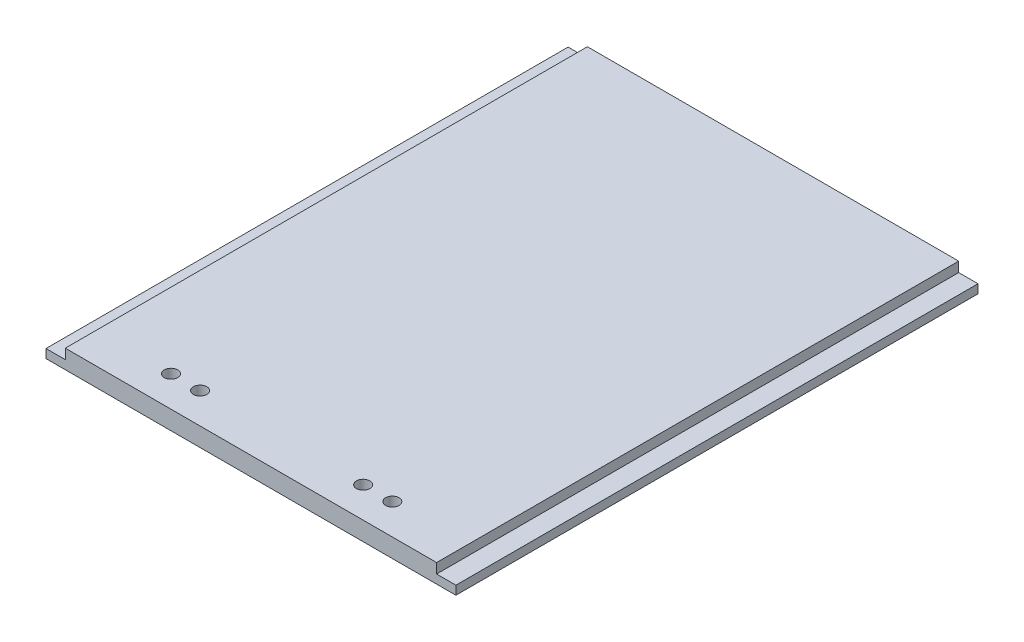
ISO-10303-21;
HEADER;
FILE_DESCRIPTION(('STEP AP214'),'2;1');
FILE_NAME('part.step','',(''),(''),'','','');
FILE_SCHEMA(('AUTOMOTIVE_DESIGN { 1 0 10303 214 1 1 1 1 }'));
ENDSEC;
DATA;
#1=APPLICATION_CONTEXT('core data for automotive mechanical design processes');
#2=APPLICATION_PROTOCOL_DEFINITION('international standard','automotive_design',2000,#1);
#3=PRODUCT_CONTEXT('',#1,'mechanical');
#4=PRODUCT('Part','Part','',(#3));
#5=PRODUCT_RELATED_PRODUCT_CATEGORY('part','',(#4));
#6=PRODUCT_DEFINITION_FORMATION('','',#4);
#7=PRODUCT_DEFINITION_CONTEXT('part definition',#1,'design');
#8=PRODUCT_DEFINITION('design','',#6,#7);
#9=PRODUCT_DEFINITION_SHAPE('','',#8);
#10=(LENGTH_UNIT() NAMED_UNIT(*) SI_UNIT(.MILLI.,.METRE.));
#11=(NAMED_UNIT(*) PLANE_ANGLE_UNIT() SI_UNIT($,.RADIAN.));
#12=(NAMED_UNIT(*) SI_UNIT($,.STERADIAN.) SOLID_ANGLE_UNIT());
#13=UNCERTAINTY_MEASURE_WITH_UNIT(LENGTH_MEASURE(1.E-05),#10,'distance_accuracy_value','');
#14=(GEOMETRIC_REPRESENTATION_CONTEXT(3) GLOBAL_UNCERTAINTY_ASSIGNED_CONTEXT((#13)) GLOBAL_UNIT_ASSIGNED_CONTEXT((#10,
#11,#12)) REPRESENTATION_CONTEXT('',''));
#15=CARTESIAN_POINT('',(0.,0.,0.));
#16=DIRECTION('',(0.,0.,1.));
#17=DIRECTION('',(1.,0.,0.));
#18=AXIS2_PLACEMENT_3D('',#15,#16,#17);
#19=CARTESIAN_POINT('',(0.,6.35,0.));
#20=DIRECTION('',(1.,0.,0.));
#21=DIRECTION('',(0.,0.,-1.));
#22=AXIS2_PLACEMENT_3D('',#19,#20,#21);
#23=PLANE('',#22);
#24=DIRECTION('',(0.,0.,1.));
#25=VECTOR('',#24,1.);
#26=CARTESIAN_POINT('',(0.,2.975,-177.292));
#27=LINE('',#26,#25);
#28=CARTESIAN_POINT('',(0.,2.975,-177.292));
#29=VERTEX_POINT('',#28);
#30=CARTESIAN_POINT('',(0.,2.975,0.));
#31=VERTEX_POINT('',#30);
#32=EDGE_CURVE('E100',#29,#31,#27,.T.);
#33=ORIENTED_EDGE('',*,*,#32,.F.);
#34=DIRECTION('',(0.,-1.,0.));
#35=VECTOR('',#34,1.);
#36=CARTESIAN_POINT('',(0.,6.35,-177.292));
#37=LINE('',#36,#35);
#38=CARTESIAN_POINT('',(0.,0.,-177.292));
#39=VERTEX_POINT('',#38);
#40=EDGE_CURVE('E122',#29,#39,#37,.T.);
#41=ORIENTED_EDGE('',*,*,#40,.T.);
#42=DIRECTION('',(0.,0.,1.));
#43=VECTOR('',#42,1.);
#44=CARTESIAN_POINT('',(0.,0.,0.));
#45=LINE('',#44,#43);
#46=CARTESIAN_POINT('',(0.,0.,0.));
#47=VERTEX_POINT('',#46);
#48=EDGE_CURVE('E121',#39,#47,#45,.T.);
#49=ORIENTED_EDGE('',*,*,#48,.T.);
#50=DIRECTION('',(0.,-1.,0.));
#51=VECTOR('',#50,1.);
#52=CARTESIAN_POINT('',(0.,6.35,0.));
#53=LINE('',#52,#51);
#54=EDGE_CURVE('E11',#31,#47,#53,.T.);
#55=ORIENTED_EDGE('',*,*,#54,.F.);
#56=EDGE_LOOP('',(#33,#41,#49,#55));
#57=FACE_BOUND('',#56,.T.);
#58=ADVANCED_FACE('F37',(#57),#23,.F.);
#59=CARTESIAN_POINT('',(139.192,6.35,0.));
#60=DIRECTION('',(-1.,0.,0.));
#61=DIRECTION('',(0.,0.,1.));
#62=AXIS2_PLACEMENT_3D('',#59,#60,#61);
#63=PLANE('',#62);
#64=DIRECTION('',(0.,0.,-1.));
#65=VECTOR('',#64,1.);
#66=CARTESIAN_POINT('',(139.192,2.975,-177.292));
#67=LINE('',#66,#65);
#68=CARTESIAN_POINT('',(139.192,2.975,0.));
#69=VERTEX_POINT('',#68);
#70=CARTESIAN_POINT('',(139.192,2.975,-177.292));
#71=VERTEX_POINT('',#70);
#72=EDGE_CURVE('E150',#69,#71,#67,.T.);
#73=ORIENTED_EDGE('',*,*,#72,.F.);
#74=DIRECTION('',(0.,-1.,0.));
#75=VECTOR('',#74,1.);
#76=CARTESIAN_POINT('',(139.192,6.35,0.));
#77=LINE('',#76,#75);
#78=CARTESIAN_POINT('',(139.192,0.,0.));
#79=VERTEX_POINT('',#78);
#80=EDGE_CURVE('E44',#69,#79,#77,.T.);
#81=ORIENTED_EDGE('',*,*,#80,.T.);
#82=DIRECTION('',(0.,0.,-1.));
#83=VECTOR('',#82,1.);
#84=CARTESIAN_POINT('',(139.192,0.,0.));
#85=LINE('',#84,#83);
#86=CARTESIAN_POINT('',(139.192,0.,-177.292));
#87=VERTEX_POINT('',#86);
#88=EDGE_CURVE('E129',#79,#87,#85,.T.);
#89=ORIENTED_EDGE('',*,*,#88,.T.);
#90=DIRECTION('',(0.,-1.,0.));
#91=VECTOR('',#90,1.);
#92=CARTESIAN_POINT('',(139.192,6.35,-177.292));
#93=LINE('',#92,#91);
#94=EDGE_CURVE('E143',#71,#87,#93,.T.);
#95=ORIENTED_EDGE('',*,*,#94,.F.);
#96=EDGE_LOOP('',(#73,#81,#89,#95));
#97=FACE_BOUND('',#96,.T.);
#98=ADVANCED_FACE('F147',(#97),#63,.F.);
#99=CARTESIAN_POINT('',(0.,6.35,0.));
#100=DIRECTION('',(0.,0.,-1.));
#101=DIRECTION('',(-1.,0.,0.));
#102=AXIS2_PLACEMENT_3D('',#99,#100,#101);
#103=PLANE('',#102);
#104=DIRECTION('',(1.,0.,0.));
#105=VECTOR('',#104,1.);
#106=CARTESIAN_POINT('',(0.,6.35,0.));
#107=LINE('',#106,#105);
#108=CARTESIAN_POINT('',(6.55000000000002,6.35,0.));
#109=VERTEX_POINT('',#108);
#110=CARTESIAN_POINT('',(132.642,6.35,0.));
#111=VERTEX_POINT('',#110);
#112=EDGE_CURVE('E141',#109,#111,#107,.T.);
#113=ORIENTED_EDGE('',*,*,#112,.F.);
#114=DIRECTION('',(0.,1.,0.));
#115=VECTOR('',#114,1.);
#116=CARTESIAN_POINT('',(6.55000000000002,2.975,0.));
#117=LINE('',#116,#115);
#118=CARTESIAN_POINT('',(6.55000000000002,2.975,0.));
#119=VERTEX_POINT('',#118);
#120=EDGE_CURVE('E59',#119,#109,#117,.T.);
#121=ORIENTED_EDGE('',*,*,#120,.F.);
#122=DIRECTION('',(1.,0.,0.));
#123=VECTOR('',#122,1.);
#124=CARTESIAN_POINT('',(0.,2.975,0.));
#125=LINE('',#124,#123);
#126=EDGE_CURVE('E104',#31,#119,#125,.T.);
#127=ORIENTED_EDGE('',*,*,#126,.F.);
#128=ORIENTED_EDGE('',*,*,#54,.T.);
#129=DIRECTION('',(1.,0.,0.));
#130=VECTOR('',#129,1.);
#131=CARTESIAN_POINT('',(0.,0.,0.));
#132=LINE('',#131,#130);
#133=EDGE_CURVE('E126',#47,#79,#132,.T.);
#134=ORIENTED_EDGE('',*,*,#133,.T.);
#135=ORIENTED_EDGE('',*,*,#80,.F.);
#136=DIRECTION('',(1.,0.,0.));
#137=VECTOR('',#136,1.);
#138=CARTESIAN_POINT('',(139.192,2.975,0.));
#139=LINE('',#138,#137);
#140=CARTESIAN_POINT('',(132.642,2.975,0.));
#141=VERTEX_POINT('',#140);
#142=EDGE_CURVE('E164',#141,#69,#139,.T.);
#143=ORIENTED_EDGE('',*,*,#142,.F.);
#144=DIRECTION('',(0.,1.,0.));
#145=VECTOR('',#144,1.);
#146=CARTESIAN_POINT('',(132.642,2.975,0.));
#147=LINE('',#146,#145);
#148=EDGE_CURVE('E172',#141,#111,#147,.T.);
#149=ORIENTED_EDGE('',*,*,#148,.T.);
#150=EDGE_LOOP('',(#113,#121,#127,#128,#134,#135,#143,#149));
#151=FACE_BOUND('',#150,.T.);
#152=ADVANCED_FACE('F114',(#151),#103,.F.);
#153=CARTESIAN_POINT('',(0.,6.35,-177.292));
#154=DIRECTION('',(0.,0.,1.));
#155=DIRECTION('',(1.,0.,0.));
#156=AXIS2_PLACEMENT_3D('',#153,#154,#155);
#157=PLANE('',#156);
#158=DIRECTION('',(-1.,0.,0.));
#159=VECTOR('',#158,1.);
#160=CARTESIAN_POINT('',(0.,2.975,-177.292));
#161=LINE('',#160,#159);
#162=CARTESIAN_POINT('',(6.55,2.975,-177.292));
#163=VERTEX_POINT('',#162);
#164=EDGE_CURVE('E106',#163,#29,#161,.T.);
#165=ORIENTED_EDGE('',*,*,#164,.F.);
#166=DIRECTION('',(0.,1.,0.));
#167=VECTOR('',#166,1.);
#168=CARTESIAN_POINT('',(6.55,2.975,-177.292));
#169=LINE('',#168,#167);
#170=CARTESIAN_POINT('',(6.55,6.35,-177.292));
#171=VERTEX_POINT('',#170);
#172=EDGE_CURVE('E127',#163,#171,#169,.T.);
#173=ORIENTED_EDGE('',*,*,#172,.T.);
#174=DIRECTION('',(-1.,0.,0.));
#175=VECTOR('',#174,1.);
#176=CARTESIAN_POINT('',(0.,6.35,-177.292));
#177=LINE('',#176,#175);
#178=CARTESIAN_POINT('',(132.642,6.35,-177.292));
#179=VERTEX_POINT('',#178);
#180=EDGE_CURVE('E134',#179,#171,#177,.T.);
#181=ORIENTED_EDGE('',*,*,#180,.F.);
#182=DIRECTION('',(0.,1.,0.));
#183=VECTOR('',#182,1.);
#184=CARTESIAN_POINT('',(132.642,2.975,-177.292));
#185=LINE('',#184,#183);
#186=CARTESIAN_POINT('',(132.642,2.975,-177.292));
#187=VERTEX_POINT('',#186);
#188=EDGE_CURVE('E51',#187,#179,#185,.T.);
#189=ORIENTED_EDGE('',*,*,#188,.F.);
#190=DIRECTION('',(-1.,0.,0.));
#191=VECTOR('',#190,1.);
#192=CARTESIAN_POINT('',(139.192,2.975,-177.292));
#193=LINE('',#192,#191);
#194=EDGE_CURVE('E157',#71,#187,#193,.T.);
#195=ORIENTED_EDGE('',*,*,#194,.F.);
#196=ORIENTED_EDGE('',*,*,#94,.T.);
#197=DIRECTION('',(-1.,0.,0.));
#198=VECTOR('',#197,1.);
#199=CARTESIAN_POINT('',(0.,0.,-177.292));
#200=LINE('',#199,#198);
#201=EDGE_CURVE('E139',#87,#39,#200,.T.);
#202=ORIENTED_EDGE('',*,*,#201,.T.);
#203=ORIENTED_EDGE('',*,*,#40,.F.);
#204=EDGE_LOOP('',(#165,#173,#181,#189,#195,#196,#202,#203));
#205=FACE_BOUND('',#204,.T.);
#206=ADVANCED_FACE('F154',(#205),#157,.F.);
#207=CARTESIAN_POINT('',(0.,6.35,0.));
#208=DIRECTION('',(0.,-1.,0.));
#209=DIRECTION('',(0.,0.,-1.));
#210=AXIS2_PLACEMENT_3D('',#207,#208,#209);
#211=PLANE('',#210);
#212=CARTESIAN_POINT('',(107.188,6.35,-10.414));
#213=DIRECTION('',(0.,-1.,0.));
#214=DIRECTION('',(0.,0.,-1.));
#215=AXIS2_PLACEMENT_3D('',#212,#213,#214);
#216=CIRCLE('',#215,2.28599999999999);
#217=CARTESIAN_POINT('',(107.188,6.35,-12.7));
#218=VERTEX_POINT('',#217);
#219=EDGE_CURVE('E166',#218,#218,#216,.T.);
#220=ORIENTED_EDGE('',*,*,#219,.T.);
#221=EDGE_LOOP('',(#220));
#222=FACE_BOUND('',#221,.T.);
#223=CARTESIAN_POINT('',(97.282,6.35,-10.414));
#224=DIRECTION('',(0.,-1.,0.));
#225=DIRECTION('',(0.,0.,-1.));
#226=AXIS2_PLACEMENT_3D('',#223,#224,#225);
#227=CIRCLE('',#226,2.28599999999999);
#228=CARTESIAN_POINT('',(97.282,6.35,-12.7));
#229=VERTEX_POINT('',#228);
#230=EDGE_CURVE('E186',#229,#229,#227,.T.);
#231=ORIENTED_EDGE('',*,*,#230,.T.);
#232=EDGE_LOOP('',(#231));
#233=FACE_BOUND('',#232,.T.);
#234=CARTESIAN_POINT('',(41.91,6.35,-10.414));
#235=DIRECTION('',(0.,-1.,0.));
#236=DIRECTION('',(0.,0.,-1.));
#237=AXIS2_PLACEMENT_3D('',#234,#235,#236);
#238=CIRCLE('',#237,2.28599999999999);
#239=CARTESIAN_POINT('',(41.91,6.35,-12.7));
#240=VERTEX_POINT('',#239);
#241=EDGE_CURVE('E189',#240,#240,#238,.T.);
#242=ORIENTED_EDGE('',*,*,#241,.T.);
#243=EDGE_LOOP('',(#242));
#244=FACE_BOUND('',#243,.T.);
#245=CARTESIAN_POINT('',(32.004,6.35,-10.414));
#246=DIRECTION('',(0.,-1.,0.));
#247=DIRECTION('',(0.,0.,-1.));
#248=AXIS2_PLACEMENT_3D('',#245,#246,#247);
#249=CIRCLE('',#248,2.28599999999999);
#250=CARTESIAN_POINT('',(32.004,6.35,-12.7));
#251=VERTEX_POINT('',#250);
#252=EDGE_CURVE('E192',#251,#251,#249,.T.);
#253=ORIENTED_EDGE('',*,*,#252,.T.);
#254=EDGE_LOOP('',(#253));
#255=FACE_BOUND('',#254,.T.);
#256=ORIENTED_EDGE('',*,*,#180,.T.);
#257=DIRECTION('',(0.,0.,-1.));
#258=VECTOR('',#257,1.);
#259=CARTESIAN_POINT('',(6.55,6.35,-177.292));
#260=LINE('',#259,#258);
#261=EDGE_CURVE('E110',#109,#171,#260,.T.);
#262=ORIENTED_EDGE('',*,*,#261,.F.);
#263=ORIENTED_EDGE('',*,*,#112,.T.);
#264=DIRECTION('',(0.,0.,1.));
#265=VECTOR('',#264,1.);
#266=CARTESIAN_POINT('',(132.642,6.35,-177.292));
#267=LINE('',#266,#265);
#268=EDGE_CURVE('E162',#179,#111,#267,.T.);
#269=ORIENTED_EDGE('',*,*,#268,.F.);
#270=EDGE_LOOP('',(#256,#262,#263,#269));
#271=FACE_BOUND('',#270,.T.);
#272=ADVANCED_FACE('F178',(#222,#233,#244,#255,#271),#211,.F.);
#273=CARTESIAN_POINT('',(0.,0.,0.));
#274=DIRECTION('',(0.,-1.,0.));
#275=DIRECTION('',(0.,0.,-1.));
#276=AXIS2_PLACEMENT_3D('',#273,#274,#275);
#277=PLANE('',#276);
#278=CARTESIAN_POINT('',(107.188,0.,-10.414));
#279=DIRECTION('',(0.,-1.,0.));
#280=DIRECTION('',(0.,0.,-1.));
#281=AXIS2_PLACEMENT_3D('',#278,#279,#280);
#282=CIRCLE('',#281,2.28599999999999);
#283=CARTESIAN_POINT('',(107.188,0.,-12.7));
#284=VERTEX_POINT('',#283);
#285=EDGE_CURVE('E195',#284,#284,#282,.T.);
#286=ORIENTED_EDGE('',*,*,#285,.F.);
#287=EDGE_LOOP('',(#286));
#288=FACE_BOUND('',#287,.T.);
#289=CARTESIAN_POINT('',(97.282,0.,-10.414));
#290=DIRECTION('',(0.,-1.,0.));
#291=DIRECTION('',(0.,0.,-1.));
#292=AXIS2_PLACEMENT_3D('',#289,#290,#291);
#293=CIRCLE('',#292,2.28599999999999);
#294=CARTESIAN_POINT('',(97.282,0.,-12.7));
#295=VERTEX_POINT('',#294);
#296=EDGE_CURVE('E202',#295,#295,#293,.T.);
#297=ORIENTED_EDGE('',*,*,#296,.F.);
#298=EDGE_LOOP('',(#297));
#299=FACE_BOUND('',#298,.T.);
#300=CARTESIAN_POINT('',(41.91,0.,-10.414));
#301=DIRECTION('',(0.,-1.,0.));
#302=DIRECTION('',(0.,0.,-1.));
#303=AXIS2_PLACEMENT_3D('',#300,#301,#302);
#304=CIRCLE('',#303,2.28599999999999);
#305=CARTESIAN_POINT('',(41.91,0.,-12.7));
#306=VERTEX_POINT('',#305);
#307=EDGE_CURVE('E199',#306,#306,#304,.T.);
#308=ORIENTED_EDGE('',*,*,#307,.F.);
#309=EDGE_LOOP('',(#308));
#310=FACE_BOUND('',#309,.T.);
#311=CARTESIAN_POINT('',(32.004,0.,-10.414));
#312=DIRECTION('',(0.,-1.,0.));
#313=DIRECTION('',(0.,0.,-1.));
#314=AXIS2_PLACEMENT_3D('',#311,#312,#313);
#315=CIRCLE('',#314,2.28599999999999);
#316=CARTESIAN_POINT('',(32.004,0.,-12.7));
#317=VERTEX_POINT('',#316);
#318=EDGE_CURVE('E196',#317,#317,#315,.T.);
#319=ORIENTED_EDGE('',*,*,#318,.F.);
#320=EDGE_LOOP('',(#319));
#321=FACE_BOUND('',#320,.T.);
#322=ORIENTED_EDGE('',*,*,#48,.F.);
#323=ORIENTED_EDGE('',*,*,#201,.F.);
#324=ORIENTED_EDGE('',*,*,#88,.F.);
#325=ORIENTED_EDGE('',*,*,#133,.F.);
#326=EDGE_LOOP('',(#322,#323,#324,#325));
#327=FACE_BOUND('',#326,.T.);
#328=ADVANCED_FACE('F152',(#288,#299,#310,#321,#327),#277,.T.);
#329=CARTESIAN_POINT('',(132.642,2.975,-177.292));
#330=DIRECTION('',(-1.,0.,0.));
#331=DIRECTION('',(0.,0.,1.));
#332=AXIS2_PLACEMENT_3D('',#329,#330,#331);
#333=PLANE('',#332);
#334=ORIENTED_EDGE('',*,*,#268,.T.);
#335=ORIENTED_EDGE('',*,*,#148,.F.);
#336=DIRECTION('',(0.,0.,1.));
#337=VECTOR('',#336,1.);
#338=CARTESIAN_POINT('',(132.642,2.975,-177.292));
#339=LINE('',#338,#337);
#340=EDGE_CURVE('E161',#187,#141,#339,.T.);
#341=ORIENTED_EDGE('',*,*,#340,.F.);
#342=ORIENTED_EDGE('',*,*,#188,.T.);
#343=EDGE_LOOP('',(#334,#335,#341,#342));
#344=FACE_BOUND('',#343,.T.);
#345=ADVANCED_FACE('F213',(#344),#333,.F.);
#346=CARTESIAN_POINT('',(0.,2.975,0.));
#347=DIRECTION('',(0.,1.,0.));
#348=DIRECTION('',(0.,0.,1.));
#349=AXIS2_PLACEMENT_3D('',#346,#347,#348);
#350=PLANE('',#349);
#351=ORIENTED_EDGE('',*,*,#194,.T.);
#352=ORIENTED_EDGE('',*,*,#340,.T.);
#353=ORIENTED_EDGE('',*,*,#142,.T.);
#354=ORIENTED_EDGE('',*,*,#72,.T.);
#355=EDGE_LOOP('',(#351,#352,#353,#354));
#356=FACE_BOUND('',#355,.T.);
#357=ADVANCED_FACE('F261',(#356),#350,.T.);
#358=CARTESIAN_POINT('',(6.55,2.975,-177.292));
#359=DIRECTION('',(1.,0.,0.));
#360=DIRECTION('',(0.,0.,-1.));
#361=AXIS2_PLACEMENT_3D('',#358,#359,#360);
#362=PLANE('',#361);
#363=ORIENTED_EDGE('',*,*,#261,.T.);
#364=ORIENTED_EDGE('',*,*,#172,.F.);
#365=DIRECTION('',(0.,0.,-1.));
#366=VECTOR('',#365,1.);
#367=CARTESIAN_POINT('',(6.55,2.975,-177.292));
#368=LINE('',#367,#366);
#369=EDGE_CURVE('E117',#119,#163,#368,.T.);
#370=ORIENTED_EDGE('',*,*,#369,.F.);
#371=ORIENTED_EDGE('',*,*,#120,.T.);
#372=EDGE_LOOP('',(#363,#364,#370,#371));
#373=FACE_BOUND('',#372,.T.);
#374=ADVANCED_FACE('F179',(#373),#362,.F.);
#375=CARTESIAN_POINT('',(0.,2.975,0.));
#376=DIRECTION('',(0.,1.,0.));
#377=DIRECTION('',(0.,0.,1.));
#378=AXIS2_PLACEMENT_3D('',#375,#376,#377);
#379=PLANE('',#378);
#380=ORIENTED_EDGE('',*,*,#32,.T.);
#381=ORIENTED_EDGE('',*,*,#126,.T.);
#382=ORIENTED_EDGE('',*,*,#369,.T.);
#383=ORIENTED_EDGE('',*,*,#164,.T.);
#384=EDGE_LOOP('',(#380,#381,#382,#383));
#385=FACE_BOUND('',#384,.T.);
#386=ADVANCED_FACE('F102',(#385),#379,.T.);
#387=CARTESIAN_POINT('',(32.004,12.7,-10.414));
#388=DIRECTION('',(0.,-1.,0.));
#389=DIRECTION('',(0.,0.,-1.));
#390=AXIS2_PLACEMENT_3D('',#387,#388,#389);
#391=CYLINDRICAL_SURFACE('',#390,2.28599999999999);
#392=ORIENTED_EDGE('',*,*,#318,.T.);
#393=EDGE_LOOP('',(#392));
#394=FACE_BOUND('',#393,.T.);
#395=ORIENTED_EDGE('',*,*,#252,.F.);
#396=EDGE_LOOP('',(#395));
#397=FACE_BOUND('',#396,.T.);
#398=ADVANCED_FACE('F221',(#394,#397),#391,.F.);
#399=CARTESIAN_POINT('',(41.91,12.7,-10.414));
#400=DIRECTION('',(0.,-1.,0.));
#401=DIRECTION('',(0.,0.,-1.));
#402=AXIS2_PLACEMENT_3D('',#399,#400,#401);
#403=CYLINDRICAL_SURFACE('',#402,2.28599999999999);
#404=ORIENTED_EDGE('',*,*,#307,.T.);
#405=EDGE_LOOP('',(#404));
#406=FACE_BOUND('',#405,.T.);
#407=ORIENTED_EDGE('',*,*,#241,.F.);
#408=EDGE_LOOP('',(#407));
#409=FACE_BOUND('',#408,.T.);
#410=ADVANCED_FACE('F224',(#406,#409),#403,.F.);
#411=CARTESIAN_POINT('',(97.282,12.7,-10.414));
#412=DIRECTION('',(0.,-1.,0.));
#413=DIRECTION('',(0.,0.,-1.));
#414=AXIS2_PLACEMENT_3D('',#411,#412,#413);
#415=CYLINDRICAL_SURFACE('',#414,2.28599999999999);
#416=ORIENTED_EDGE('',*,*,#296,.T.);
#417=EDGE_LOOP('',(#416));
#418=FACE_BOUND('',#417,.T.);
#419=ORIENTED_EDGE('',*,*,#230,.F.);
#420=EDGE_LOOP('',(#419));
#421=FACE_BOUND('',#420,.T.);
#422=ADVANCED_FACE('F310',(#418,#421),#415,.F.);
#423=CARTESIAN_POINT('',(107.188,12.7,-10.414));
#424=DIRECTION('',(0.,-1.,0.));
#425=DIRECTION('',(0.,0.,-1.));
#426=AXIS2_PLACEMENT_3D('',#423,#424,#425);
#427=CYLINDRICAL_SURFACE('',#426,2.28599999999999);
#428=ORIENTED_EDGE('',*,*,#285,.T.);
#429=EDGE_LOOP('',(#428));
#430=FACE_BOUND('',#429,.T.);
#431=ORIENTED_EDGE('',*,*,#219,.F.);
#432=EDGE_LOOP('',(#431));
#433=FACE_BOUND('',#432,.T.);
#434=ADVANCED_FACE('F208',(#430,#433),#427,.F.);
#435=CLOSED_SHELL('',(#58,#98,#152,#206,#272,#328,#345,#357,#374,#386,#398,#410,#422,#434));
#436=MANIFOLD_SOLID_BREP('B2',#435);
#437=ADVANCED_BREP_SHAPE_REPRESENTATION('',(#18,#436),#14);
#438=SHAPE_DEFINITION_REPRESENTATION(#9,#437);
ENDSEC;
END-ISO-10303-21;
